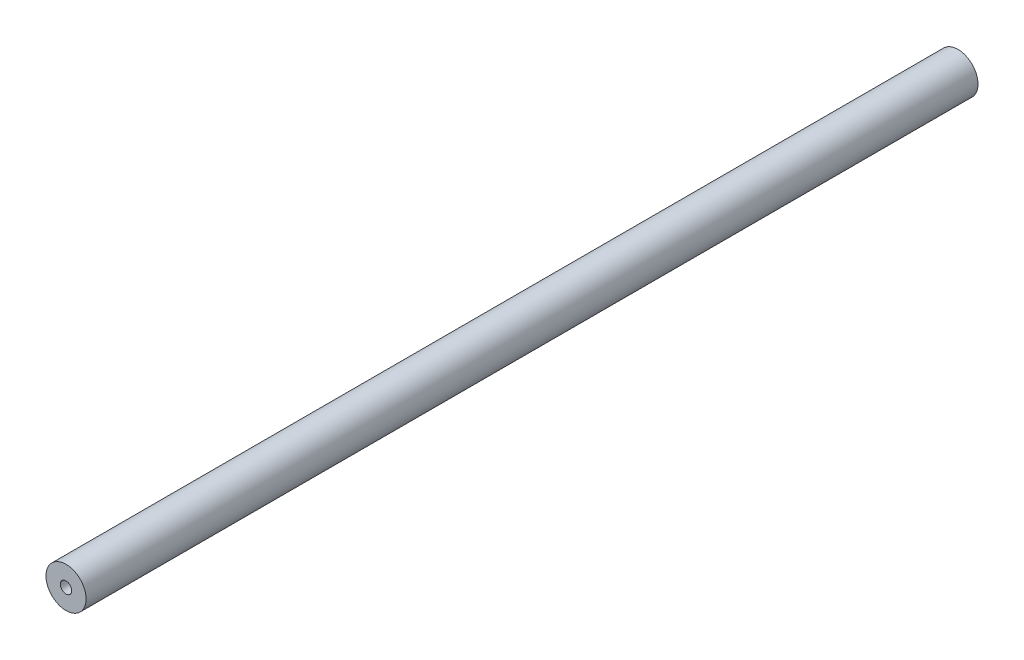
ISO-10303-21;
HEADER;
FILE_DESCRIPTION(('STEP AP214'),'2;1');
FILE_NAME('part.step','',(''),(''),'','','');
FILE_SCHEMA(('AUTOMOTIVE_DESIGN { 1 0 10303 214 1 1 1 1 }'));
ENDSEC;
DATA;
#1=APPLICATION_CONTEXT('core data for automotive mechanical design processes');
#2=APPLICATION_PROTOCOL_DEFINITION('international standard','automotive_design',2000,#1);
#3=PRODUCT_CONTEXT('',#1,'mechanical');
#4=PRODUCT('Part','Part','',(#3));
#5=PRODUCT_RELATED_PRODUCT_CATEGORY('part','',(#4));
#6=PRODUCT_DEFINITION_FORMATION('','',#4);
#7=PRODUCT_DEFINITION_CONTEXT('part definition',#1,'design');
#8=PRODUCT_DEFINITION('design','',#6,#7);
#9=PRODUCT_DEFINITION_SHAPE('','',#8);
#10=(LENGTH_UNIT() NAMED_UNIT(*) SI_UNIT(.MILLI.,.METRE.));
#11=(NAMED_UNIT(*) PLANE_ANGLE_UNIT() SI_UNIT($,.RADIAN.));
#12=(NAMED_UNIT(*) SI_UNIT($,.STERADIAN.) SOLID_ANGLE_UNIT());
#13=UNCERTAINTY_MEASURE_WITH_UNIT(LENGTH_MEASURE(1.E-05),#10,'distance_accuracy_value','');
#14=(GEOMETRIC_REPRESENTATION_CONTEXT(3) GLOBAL_UNCERTAINTY_ASSIGNED_CONTEXT((#13)) GLOBAL_UNIT_ASSIGNED_CONTEXT((#10,
#11,#12)) REPRESENTATION_CONTEXT('',''));
#15=CARTESIAN_POINT('',(0.,0.,0.));
#16=DIRECTION('',(0.,0.,1.));
#17=DIRECTION('',(1.,0.,0.));
#18=AXIS2_PLACEMENT_3D('',#15,#16,#17);
#19=CARTESIAN_POINT('',(0.,0.,177.8));
#20=DIRECTION('',(0.,0.,1.));
#21=DIRECTION('',(1.,0.,0.));
#22=AXIS2_PLACEMENT_3D('',#19,#20,#21);
#23=PLANE('',#22);
#24=CARTESIAN_POINT('',(0.,0.,177.8));
#25=DIRECTION('',(0.,0.,1.));
#26=DIRECTION('',(1.,0.,0.));
#27=AXIS2_PLACEMENT_3D('',#24,#25,#26);
#28=CIRCLE('',#27,4.);
#29=CARTESIAN_POINT('',(4.,0.,177.8));
#30=VERTEX_POINT('',#29);
#31=EDGE_CURVE('E10',#30,#30,#28,.T.);
#32=ORIENTED_EDGE('',*,*,#31,.T.);
#33=EDGE_LOOP('',(#32));
#34=FACE_BOUND('',#33,.T.);
#35=CARTESIAN_POINT('',(0.,0.,177.8));
#36=DIRECTION('',(0.,0.,1.));
#37=DIRECTION('',(1.,0.,0.));
#38=AXIS2_PLACEMENT_3D('',#35,#36,#37);
#39=CIRCLE('',#38,1.1303);
#40=CARTESIAN_POINT('',(1.1303,0.,177.8));
#41=VERTEX_POINT('',#40);
#42=EDGE_CURVE('E42',#41,#41,#39,.T.);
#43=ORIENTED_EDGE('',*,*,#42,.F.);
#44=EDGE_LOOP('',(#43));
#45=FACE_BOUND('',#44,.T.);
#46=ADVANCED_FACE('F31',(#34,#45),#23,.T.);
#47=CARTESIAN_POINT('',(0.,0.,0.));
#48=DIRECTION('',(0.,0.,1.));
#49=DIRECTION('',(1.,0.,0.));
#50=AXIS2_PLACEMENT_3D('',#47,#48,#49);
#51=PLANE('',#50);
#52=CARTESIAN_POINT('',(0.,0.,0.));
#53=DIRECTION('',(0.,0.,1.));
#54=DIRECTION('',(1.,0.,0.));
#55=AXIS2_PLACEMENT_3D('',#52,#53,#54);
#56=CIRCLE('',#55,4.);
#57=CARTESIAN_POINT('',(4.,0.,0.));
#58=VERTEX_POINT('',#57);
#59=EDGE_CURVE('E35',#58,#58,#56,.T.);
#60=ORIENTED_EDGE('',*,*,#59,.F.);
#61=EDGE_LOOP('',(#60));
#62=FACE_BOUND('',#61,.T.);
#63=CARTESIAN_POINT('',(0.,0.,0.));
#64=DIRECTION('',(0.,0.,1.));
#65=DIRECTION('',(1.,0.,0.));
#66=AXIS2_PLACEMENT_3D('',#63,#64,#65);
#67=CIRCLE('',#66,1.1303);
#68=CARTESIAN_POINT('',(1.1303,0.,0.));
#69=VERTEX_POINT('',#68);
#70=EDGE_CURVE('E44',#69,#69,#67,.T.);
#71=ORIENTED_EDGE('',*,*,#70,.T.);
#72=EDGE_LOOP('',(#71));
#73=FACE_BOUND('',#72,.T.);
#74=ADVANCED_FACE('F54',(#62,#73),#51,.F.);
#75=CARTESIAN_POINT('',(0.,0.,177.8));
#76=DIRECTION('',(0.,0.,-1.));
#77=DIRECTION('',(-1.,0.,0.));
#78=AXIS2_PLACEMENT_3D('',#75,#76,#77);
#79=CYLINDRICAL_SURFACE('',#78,4.);
#80=ORIENTED_EDGE('',*,*,#31,.F.);
#81=EDGE_LOOP('',(#80));
#82=FACE_BOUND('',#81,.T.);
#83=ORIENTED_EDGE('',*,*,#59,.T.);
#84=EDGE_LOOP('',(#83));
#85=FACE_BOUND('',#84,.T.);
#86=ADVANCED_FACE('F33',(#82,#85),#79,.T.);
#87=CARTESIAN_POINT('',(0.,0.,177.8));
#88=DIRECTION('',(0.,0.,-1.));
#89=DIRECTION('',(-1.,0.,0.));
#90=AXIS2_PLACEMENT_3D('',#87,#88,#89);
#91=CYLINDRICAL_SURFACE('',#90,1.1303);
#92=ORIENTED_EDGE('',*,*,#42,.T.);
#93=EDGE_LOOP('',(#92));
#94=FACE_BOUND('',#93,.T.);
#95=ORIENTED_EDGE('',*,*,#70,.F.);
#96=EDGE_LOOP('',(#95));
#97=FACE_BOUND('',#96,.T.);
#98=ADVANCED_FACE('F50',(#94,#97),#91,.F.);
#99=CLOSED_SHELL('',(#46,#74,#86,#98));
#100=MANIFOLD_SOLID_BREP('B2',#99);
#101=ADVANCED_BREP_SHAPE_REPRESENTATION('',(#18,#100),#14);
#102=SHAPE_DEFINITION_REPRESENTATION(#9,#101);
ENDSEC;
END-ISO-10303-21;
